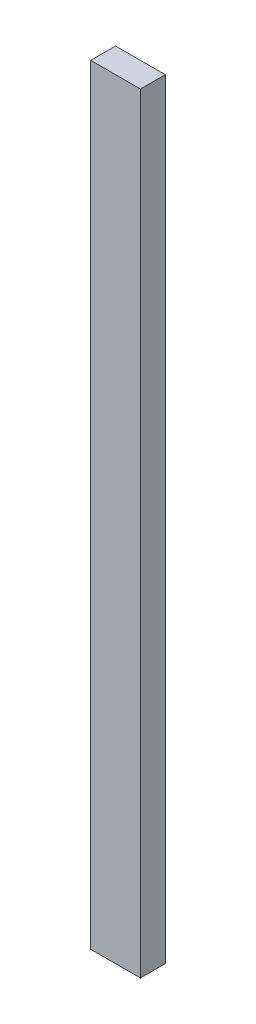
ISO-10303-21;
HEADER;
FILE_DESCRIPTION(('STEP AP214'),'2;1');
FILE_NAME('part.step','',(''),(''),'','','');
FILE_SCHEMA(('AUTOMOTIVE_DESIGN { 1 0 10303 214 1 1 1 1 }'));
ENDSEC;
DATA;
#1=APPLICATION_CONTEXT('core data for automotive mechanical design processes');
#2=APPLICATION_PROTOCOL_DEFINITION('international standard','automotive_design',2000,#1);
#3=PRODUCT_CONTEXT('',#1,'mechanical');
#4=PRODUCT('Part','Part','',(#3));
#5=PRODUCT_RELATED_PRODUCT_CATEGORY('part','',(#4));
#6=PRODUCT_DEFINITION_FORMATION('','',#4);
#7=PRODUCT_DEFINITION_CONTEXT('part definition',#1,'design');
#8=PRODUCT_DEFINITION('design','',#6,#7);
#9=PRODUCT_DEFINITION_SHAPE('','',#8);
#10=(LENGTH_UNIT() NAMED_UNIT(*) SI_UNIT(.MILLI.,.METRE.));
#11=(NAMED_UNIT(*) PLANE_ANGLE_UNIT() SI_UNIT($,.RADIAN.));
#12=(NAMED_UNIT(*) SI_UNIT($,.STERADIAN.) SOLID_ANGLE_UNIT());
#13=UNCERTAINTY_MEASURE_WITH_UNIT(LENGTH_MEASURE(1.E-05),#10,'distance_accuracy_value','');
#14=(GEOMETRIC_REPRESENTATION_CONTEXT(3) GLOBAL_UNCERTAINTY_ASSIGNED_CONTEXT((#13)) GLOBAL_UNIT_ASSIGNED_CONTEXT((#10,
#11,#12)) REPRESENTATION_CONTEXT('',''));
#15=CARTESIAN_POINT('',(0.,0.,0.));
#16=DIRECTION('',(0.,0.,1.));
#17=DIRECTION('',(1.,0.,0.));
#18=AXIS2_PLACEMENT_3D('',#15,#16,#17);
#19=CARTESIAN_POINT('',(0.,787.4,0.));
#20=DIRECTION('',(1.,0.,0.));
#21=DIRECTION('',(0.,0.,-1.));
#22=AXIS2_PLACEMENT_3D('',#19,#20,#21);
#23=PLANE('',#22);
#24=DIRECTION('',(0.,0.,1.));
#25=VECTOR('',#24,1.);
#26=CARTESIAN_POINT('',(0.,0.,0.));
#27=LINE('',#26,#25);
#28=CARTESIAN_POINT('',(0.,0.,-25.4000000000001));
#29=VERTEX_POINT('',#28);
#30=CARTESIAN_POINT('',(0.,0.,0.));
#31=VERTEX_POINT('',#30);
#32=EDGE_CURVE('E97',#29,#31,#27,.T.);
#33=ORIENTED_EDGE('',*,*,#32,.T.);
#34=DIRECTION('',(0.,-1.,0.));
#35=VECTOR('',#34,1.);
#36=CARTESIAN_POINT('',(0.,787.4,0.));
#37=LINE('',#36,#35);
#38=CARTESIAN_POINT('',(0.,787.4,0.));
#39=VERTEX_POINT('',#38);
#40=EDGE_CURVE('E11',#39,#31,#37,.T.);
#41=ORIENTED_EDGE('',*,*,#40,.F.);
#42=DIRECTION('',(0.,0.,1.));
#43=VECTOR('',#42,1.);
#44=CARTESIAN_POINT('',(0.,787.4,0.));
#45=LINE('',#44,#43);
#46=CARTESIAN_POINT('',(0.,787.4,-25.4000000000001));
#47=VERTEX_POINT('',#46);
#48=EDGE_CURVE('E85',#47,#39,#45,.T.);
#49=ORIENTED_EDGE('',*,*,#48,.F.);
#50=DIRECTION('',(0.,-1.,0.));
#51=VECTOR('',#50,1.);
#52=CARTESIAN_POINT('',(0.,787.4,-25.4000000000001));
#53=LINE('',#52,#51);
#54=EDGE_CURVE('E93',#47,#29,#53,.T.);
#55=ORIENTED_EDGE('',*,*,#54,.T.);
#56=EDGE_LOOP('',(#33,#41,#49,#55));
#57=FACE_BOUND('',#56,.T.);
#58=ADVANCED_FACE('F34',(#57),#23,.F.);
#59=CARTESIAN_POINT('',(0.,787.4,0.));
#60=DIRECTION('',(0.,0.,-1.));
#61=DIRECTION('',(-1.,0.,0.));
#62=AXIS2_PLACEMENT_3D('',#59,#60,#61);
#63=PLANE('',#62);
#64=DIRECTION('',(1.,0.,0.));
#65=VECTOR('',#64,1.);
#66=CARTESIAN_POINT('',(0.,0.,0.));
#67=LINE('',#66,#65);
#68=CARTESIAN_POINT('',(50.8,0.,0.));
#69=VERTEX_POINT('',#68);
#70=EDGE_CURVE('E89',#31,#69,#67,.T.);
#71=ORIENTED_EDGE('',*,*,#70,.T.);
#72=DIRECTION('',(0.,-1.,0.));
#73=VECTOR('',#72,1.);
#74=CARTESIAN_POINT('',(50.8,787.4,0.));
#75=LINE('',#74,#73);
#76=CARTESIAN_POINT('',(50.8,787.4,0.));
#77=VERTEX_POINT('',#76);
#78=EDGE_CURVE('E42',#77,#69,#75,.T.);
#79=ORIENTED_EDGE('',*,*,#78,.F.);
#80=DIRECTION('',(1.,0.,0.));
#81=VECTOR('',#80,1.);
#82=CARTESIAN_POINT('',(0.,787.4,0.));
#83=LINE('',#82,#81);
#84=EDGE_CURVE('E80',#39,#77,#83,.T.);
#85=ORIENTED_EDGE('',*,*,#84,.F.);
#86=ORIENTED_EDGE('',*,*,#40,.T.);
#87=EDGE_LOOP('',(#71,#79,#85,#86));
#88=FACE_BOUND('',#87,.T.);
#89=ADVANCED_FACE('F88',(#88),#63,.F.);
#90=CARTESIAN_POINT('',(50.8,787.4,0.));
#91=DIRECTION('',(-1.,0.,0.));
#92=DIRECTION('',(0.,0.,1.));
#93=AXIS2_PLACEMENT_3D('',#90,#91,#92);
#94=PLANE('',#93);
#95=DIRECTION('',(0.,0.,-1.));
#96=VECTOR('',#95,1.);
#97=CARTESIAN_POINT('',(50.8,0.,0.));
#98=LINE('',#97,#96);
#99=CARTESIAN_POINT('',(50.8,0.,-25.4000000000001));
#100=VERTEX_POINT('',#99);
#101=EDGE_CURVE('E67',#69,#100,#98,.T.);
#102=ORIENTED_EDGE('',*,*,#101,.T.);
#103=DIRECTION('',(0.,-1.,0.));
#104=VECTOR('',#103,1.);
#105=CARTESIAN_POINT('',(50.8,787.4,-25.4000000000001));
#106=LINE('',#105,#104);
#107=CARTESIAN_POINT('',(50.8,787.4,-25.4000000000001));
#108=VERTEX_POINT('',#107);
#109=EDGE_CURVE('E90',#108,#100,#106,.T.);
#110=ORIENTED_EDGE('',*,*,#109,.F.);
#111=DIRECTION('',(0.,0.,-1.));
#112=VECTOR('',#111,1.);
#113=CARTESIAN_POINT('',(50.8,787.4,0.));
#114=LINE('',#113,#112);
#115=EDGE_CURVE('E83',#77,#108,#114,.T.);
#116=ORIENTED_EDGE('',*,*,#115,.F.);
#117=ORIENTED_EDGE('',*,*,#78,.T.);
#118=EDGE_LOOP('',(#102,#110,#116,#117));
#119=FACE_BOUND('',#118,.T.);
#120=ADVANCED_FACE('F91',(#119),#94,.F.);
#121=CARTESIAN_POINT('',(0.,787.4,-25.4000000000001));
#122=DIRECTION('',(0.,0.,1.));
#123=DIRECTION('',(1.,0.,0.));
#124=AXIS2_PLACEMENT_3D('',#121,#122,#123);
#125=PLANE('',#124);
#126=DIRECTION('',(-1.,0.,0.));
#127=VECTOR('',#126,1.);
#128=CARTESIAN_POINT('',(0.,0.,-25.4000000000001));
#129=LINE('',#128,#127);
#130=EDGE_CURVE('E73',#100,#29,#129,.T.);
#131=ORIENTED_EDGE('',*,*,#130,.T.);
#132=ORIENTED_EDGE('',*,*,#54,.F.);
#133=DIRECTION('',(-1.,0.,0.));
#134=VECTOR('',#133,1.);
#135=CARTESIAN_POINT('',(0.,787.4,-25.4000000000001));
#136=LINE('',#135,#134);
#137=EDGE_CURVE('E50',#108,#47,#136,.T.);
#138=ORIENTED_EDGE('',*,*,#137,.F.);
#139=ORIENTED_EDGE('',*,*,#109,.T.);
#140=EDGE_LOOP('',(#131,#132,#138,#139));
#141=FACE_BOUND('',#140,.T.);
#142=ADVANCED_FACE('F104',(#141),#125,.F.);
#143=CARTESIAN_POINT('',(0.,787.4,0.));
#144=DIRECTION('',(0.,-1.,0.));
#145=DIRECTION('',(0.,0.,-1.));
#146=AXIS2_PLACEMENT_3D('',#143,#144,#145);
#147=PLANE('',#146);
#148=ORIENTED_EDGE('',*,*,#48,.T.);
#149=ORIENTED_EDGE('',*,*,#84,.T.);
#150=ORIENTED_EDGE('',*,*,#115,.T.);
#151=ORIENTED_EDGE('',*,*,#137,.T.);
#152=EDGE_LOOP('',(#148,#149,#150,#151));
#153=FACE_BOUND('',#152,.T.);
#154=ADVANCED_FACE('F81',(#153),#147,.F.);
#155=CARTESIAN_POINT('',(0.,0.,0.));
#156=DIRECTION('',(0.,-1.,0.));
#157=DIRECTION('',(0.,0.,-1.));
#158=AXIS2_PLACEMENT_3D('',#155,#156,#157);
#159=PLANE('',#158);
#160=ORIENTED_EDGE('',*,*,#32,.F.);
#161=ORIENTED_EDGE('',*,*,#130,.F.);
#162=ORIENTED_EDGE('',*,*,#101,.F.);
#163=ORIENTED_EDGE('',*,*,#70,.F.);
#164=EDGE_LOOP('',(#160,#161,#162,#163));
#165=FACE_BOUND('',#164,.T.);
#166=ADVANCED_FACE('F107',(#165),#159,.T.);
#167=CLOSED_SHELL('',(#58,#89,#120,#142,#154,#166));
#168=MANIFOLD_SOLID_BREP('B2',#167);
#169=ADVANCED_BREP_SHAPE_REPRESENTATION('',(#18,#168),#14);
#170=SHAPE_DEFINITION_REPRESENTATION(#9,#169);
ENDSEC;
END-ISO-10303-21;
